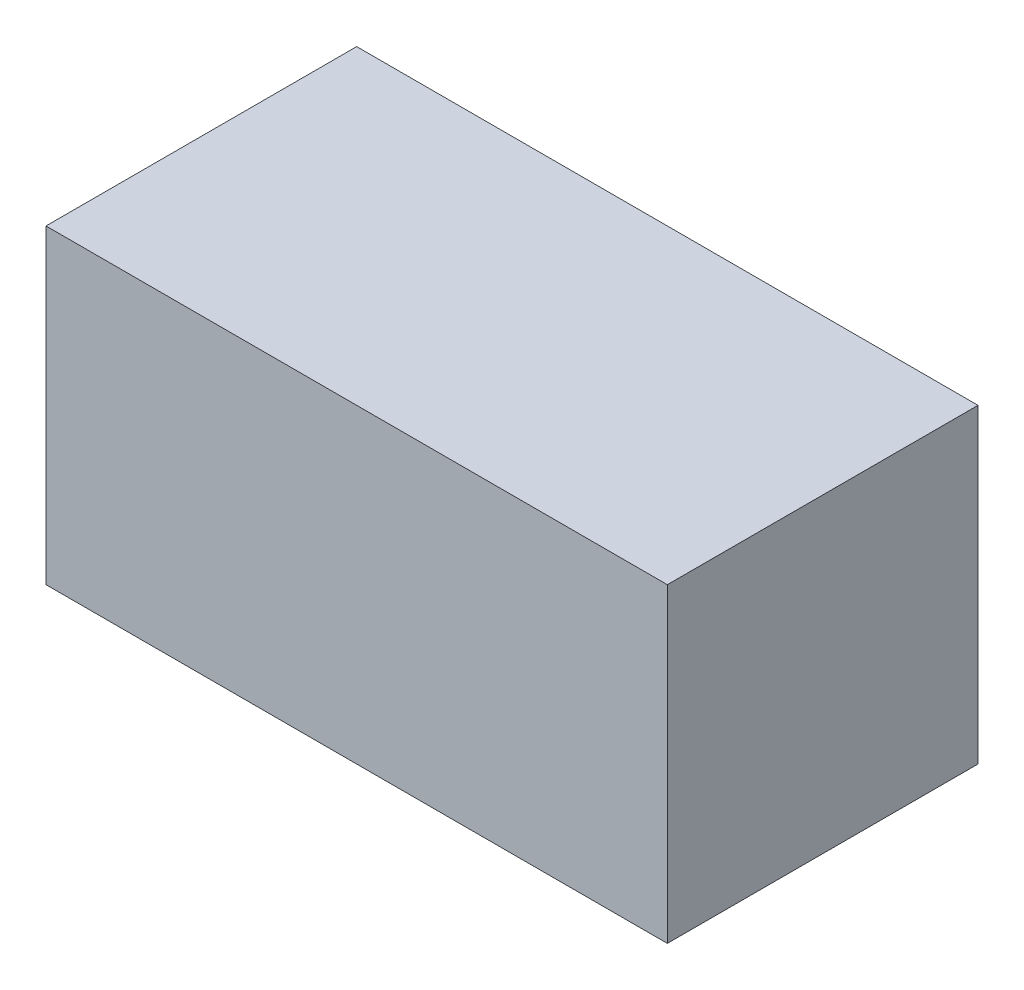
ISO-10303-21;
HEADER;
FILE_DESCRIPTION(('STEP AP214'),'2;1');
FILE_NAME('part.step','',(''),(''),'','','');
FILE_SCHEMA(('AUTOMOTIVE_DESIGN { 1 0 10303 214 1 1 1 1 }'));
ENDSEC;
DATA;
#1=APPLICATION_CONTEXT('core data for automotive mechanical design processes');
#2=APPLICATION_PROTOCOL_DEFINITION('international standard','automotive_design',2000,#1);
#3=PRODUCT_CONTEXT('',#1,'mechanical');
#4=PRODUCT('Part','Part','',(#3));
#5=PRODUCT_RELATED_PRODUCT_CATEGORY('part','',(#4));
#6=PRODUCT_DEFINITION_FORMATION('','',#4);
#7=PRODUCT_DEFINITION_CONTEXT('part definition',#1,'design');
#8=PRODUCT_DEFINITION('design','',#6,#7);
#9=PRODUCT_DEFINITION_SHAPE('','',#8);
#10=(LENGTH_UNIT() NAMED_UNIT(*) SI_UNIT(.MILLI.,.METRE.));
#11=(NAMED_UNIT(*) PLANE_ANGLE_UNIT() SI_UNIT($,.RADIAN.));
#12=(NAMED_UNIT(*) SI_UNIT($,.STERADIAN.) SOLID_ANGLE_UNIT());
#13=UNCERTAINTY_MEASURE_WITH_UNIT(LENGTH_MEASURE(1.E-05),#10,'distance_accuracy_value','');
#14=(GEOMETRIC_REPRESENTATION_CONTEXT(3) GLOBAL_UNCERTAINTY_ASSIGNED_CONTEXT((#13)) GLOBAL_UNIT_ASSIGNED_CONTEXT((#10,
#11,#12)) REPRESENTATION_CONTEXT('',''));
#15=CARTESIAN_POINT('',(0.,0.,0.));
#16=DIRECTION('',(0.,0.,1.));
#17=DIRECTION('',(1.,0.,0.));
#18=AXIS2_PLACEMENT_3D('',#15,#16,#17);
#19=CARTESIAN_POINT('',(1.,-0.5,1.));
#20=DIRECTION('',(-1.,0.,0.));
#21=DIRECTION('',(0.,0.,1.));
#22=AXIS2_PLACEMENT_3D('',#19,#20,#21);
#23=PLANE('',#22);
#24=DIRECTION('',(0.,1.,0.));
#25=VECTOR('',#24,1.);
#26=CARTESIAN_POINT('',(1.,-0.5,0.));
#27=LINE('',#26,#25);
#28=CARTESIAN_POINT('',(1.,-0.5,0.));
#29=VERTEX_POINT('',#28);
#30=CARTESIAN_POINT('',(1.,0.5,0.));
#31=VERTEX_POINT('',#30);
#32=EDGE_CURVE('E107',#29,#31,#27,.T.);
#33=ORIENTED_EDGE('',*,*,#32,.T.);
#34=DIRECTION('',(0.,0.,-1.));
#35=VECTOR('',#34,1.);
#36=CARTESIAN_POINT('',(1.,0.5,1.));
#37=LINE('',#36,#35);
#38=CARTESIAN_POINT('',(1.,0.5,1.));
#39=VERTEX_POINT('',#38);
#40=EDGE_CURVE('E11',#39,#31,#37,.T.);
#41=ORIENTED_EDGE('',*,*,#40,.F.);
#42=DIRECTION('',(0.,1.,0.));
#43=VECTOR('',#42,1.);
#44=CARTESIAN_POINT('',(1.,-0.5,1.));
#45=LINE('',#44,#43);
#46=CARTESIAN_POINT('',(1.,-0.5,1.));
#47=VERTEX_POINT('',#46);
#48=EDGE_CURVE('E91',#47,#39,#45,.T.);
#49=ORIENTED_EDGE('',*,*,#48,.F.);
#50=DIRECTION('',(0.,0.,-1.));
#51=VECTOR('',#50,1.);
#52=CARTESIAN_POINT('',(1.,-0.5,1.));
#53=LINE('',#52,#51);
#54=EDGE_CURVE('E103',#47,#29,#53,.T.);
#55=ORIENTED_EDGE('',*,*,#54,.T.);
#56=EDGE_LOOP('',(#33,#41,#49,#55));
#57=FACE_BOUND('',#56,.T.);
#58=ADVANCED_FACE('F39',(#57),#23,.F.);
#59=CARTESIAN_POINT('',(-1.,0.5,1.));
#60=DIRECTION('',(0.,-1.,0.));
#61=DIRECTION('',(0.,0.,-1.));
#62=AXIS2_PLACEMENT_3D('',#59,#60,#61);
#63=PLANE('',#62);
#64=DIRECTION('',(-1.,0.,0.));
#65=VECTOR('',#64,1.);
#66=CARTESIAN_POINT('',(-1.,0.5,0.));
#67=LINE('',#66,#65);
#68=CARTESIAN_POINT('',(-1.,0.5,0.));
#69=VERTEX_POINT('',#68);
#70=EDGE_CURVE('E96',#31,#69,#67,.T.);
#71=ORIENTED_EDGE('',*,*,#70,.T.);
#72=DIRECTION('',(0.,0.,-1.));
#73=VECTOR('',#72,1.);
#74=CARTESIAN_POINT('',(-1.,0.5,1.));
#75=LINE('',#74,#73);
#76=CARTESIAN_POINT('',(-1.,0.5,1.));
#77=VERTEX_POINT('',#76);
#78=EDGE_CURVE('E48',#77,#69,#75,.T.);
#79=ORIENTED_EDGE('',*,*,#78,.F.);
#80=DIRECTION('',(-1.,0.,0.));
#81=VECTOR('',#80,1.);
#82=CARTESIAN_POINT('',(-1.,0.5,1.));
#83=LINE('',#82,#81);
#84=EDGE_CURVE('E86',#39,#77,#83,.T.);
#85=ORIENTED_EDGE('',*,*,#84,.F.);
#86=ORIENTED_EDGE('',*,*,#40,.T.);
#87=EDGE_LOOP('',(#71,#79,#85,#86));
#88=FACE_BOUND('',#87,.T.);
#89=ADVANCED_FACE('F95',(#88),#63,.F.);
#90=CARTESIAN_POINT('',(-1.,-0.5,1.));
#91=DIRECTION('',(1.,0.,0.));
#92=DIRECTION('',(0.,0.,-1.));
#93=AXIS2_PLACEMENT_3D('',#90,#91,#92);
#94=PLANE('',#93);
#95=DIRECTION('',(0.,-1.,0.));
#96=VECTOR('',#95,1.);
#97=CARTESIAN_POINT('',(-1.,-0.5,0.));
#98=LINE('',#97,#96);
#99=CARTESIAN_POINT('',(-1.,-0.5,0.));
#100=VERTEX_POINT('',#99);
#101=EDGE_CURVE('E73',#69,#100,#98,.T.);
#102=ORIENTED_EDGE('',*,*,#101,.T.);
#103=DIRECTION('',(0.,0.,-1.));
#104=VECTOR('',#103,1.);
#105=CARTESIAN_POINT('',(-1.,-0.5,1.));
#106=LINE('',#105,#104);
#107=CARTESIAN_POINT('',(-1.,-0.5,1.));
#108=VERTEX_POINT('',#107);
#109=EDGE_CURVE('E98',#108,#100,#106,.T.);
#110=ORIENTED_EDGE('',*,*,#109,.F.);
#111=DIRECTION('',(0.,-1.,0.));
#112=VECTOR('',#111,1.);
#113=CARTESIAN_POINT('',(-1.,-0.5,1.));
#114=LINE('',#113,#112);
#115=EDGE_CURVE('E89',#77,#108,#114,.T.);
#116=ORIENTED_EDGE('',*,*,#115,.F.);
#117=ORIENTED_EDGE('',*,*,#78,.T.);
#118=EDGE_LOOP('',(#102,#110,#116,#117));
#119=FACE_BOUND('',#118,.T.);
#120=ADVANCED_FACE('F99',(#119),#94,.F.);
#121=CARTESIAN_POINT('',(-1.,-0.5,1.));
#122=DIRECTION('',(0.,1.,0.));
#123=DIRECTION('',(0.,0.,1.));
#124=AXIS2_PLACEMENT_3D('',#121,#122,#123);
#125=PLANE('',#124);
#126=DIRECTION('',(1.,0.,0.));
#127=VECTOR('',#126,1.);
#128=CARTESIAN_POINT('',(-1.,-0.5,0.));
#129=LINE('',#128,#127);
#130=EDGE_CURVE('E79',#100,#29,#129,.T.);
#131=ORIENTED_EDGE('',*,*,#130,.T.);
#132=ORIENTED_EDGE('',*,*,#54,.F.);
#133=DIRECTION('',(1.,0.,0.));
#134=VECTOR('',#133,1.);
#135=CARTESIAN_POINT('',(-1.,-0.5,1.));
#136=LINE('',#135,#134);
#137=EDGE_CURVE('E56',#108,#47,#136,.T.);
#138=ORIENTED_EDGE('',*,*,#137,.F.);
#139=ORIENTED_EDGE('',*,*,#109,.T.);
#140=EDGE_LOOP('',(#131,#132,#138,#139));
#141=FACE_BOUND('',#140,.T.);
#142=ADVANCED_FACE('F120',(#141),#125,.F.);
#143=CARTESIAN_POINT('',(0.,0.,1.));
#144=DIRECTION('',(0.,0.,-1.));
#145=DIRECTION('',(-1.,0.,0.));
#146=AXIS2_PLACEMENT_3D('',#143,#144,#145);
#147=PLANE('',#146);
#148=ORIENTED_EDGE('',*,*,#48,.T.);
#149=ORIENTED_EDGE('',*,*,#84,.T.);
#150=ORIENTED_EDGE('',*,*,#115,.T.);
#151=ORIENTED_EDGE('',*,*,#137,.T.);
#152=EDGE_LOOP('',(#148,#149,#150,#151));
#153=FACE_BOUND('',#152,.T.);
#154=ADVANCED_FACE('F87',(#153),#147,.F.);
#155=CARTESIAN_POINT('',(0.,0.,0.));
#156=DIRECTION('',(0.,0.,-1.));
#157=DIRECTION('',(-1.,0.,0.));
#158=AXIS2_PLACEMENT_3D('',#155,#156,#157);
#159=PLANE('',#158);
#160=ORIENTED_EDGE('',*,*,#32,.F.);
#161=ORIENTED_EDGE('',*,*,#130,.F.);
#162=ORIENTED_EDGE('',*,*,#101,.F.);
#163=ORIENTED_EDGE('',*,*,#70,.F.);
#164=EDGE_LOOP('',(#160,#161,#162,#163));
#165=FACE_BOUND('',#164,.T.);
#166=ADVANCED_FACE('F123',(#165),#159,.T.);
#167=CLOSED_SHELL('',(#58,#89,#120,#142,#154,#166));
#168=MANIFOLD_SOLID_BREP('B2',#167);
#169=ADVANCED_BREP_SHAPE_REPRESENTATION('',(#18,#168),#14);
#170=SHAPE_DEFINITION_REPRESENTATION(#9,#169);
ENDSEC;
END-ISO-10303-21;
